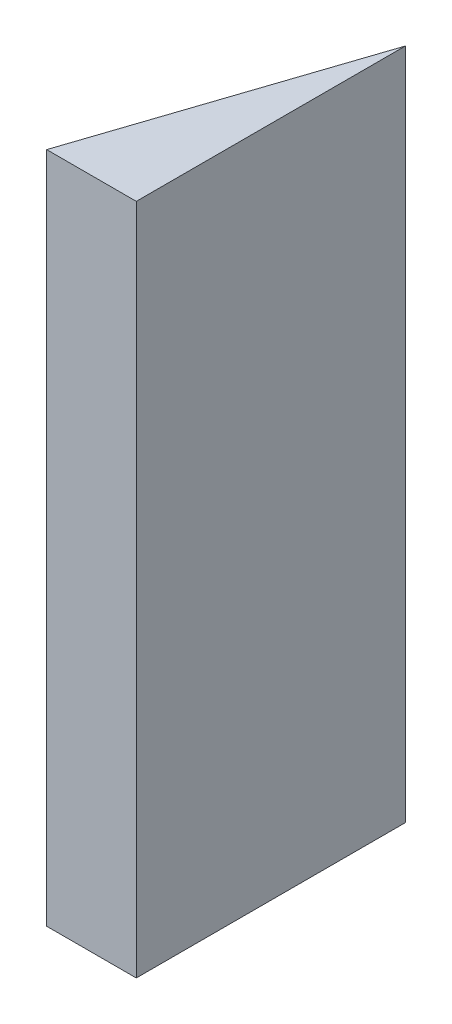
ISO-10303-21;
HEADER;
FILE_DESCRIPTION(('STEP AP214'),'2;1');
FILE_NAME('part.step','',(''),(''),'','','');
FILE_SCHEMA(('AUTOMOTIVE_DESIGN { 1 0 10303 214 1 1 1 1 }'));
ENDSEC;
DATA;
#1=APPLICATION_CONTEXT('core data for automotive mechanical design processes');
#2=APPLICATION_PROTOCOL_DEFINITION('international standard','automotive_design',2000,#1);
#3=PRODUCT_CONTEXT('',#1,'mechanical');
#4=PRODUCT('Part','Part','',(#3));
#5=PRODUCT_RELATED_PRODUCT_CATEGORY('part','',(#4));
#6=PRODUCT_DEFINITION_FORMATION('','',#4);
#7=PRODUCT_DEFINITION_CONTEXT('part definition',#1,'design');
#8=PRODUCT_DEFINITION('design','',#6,#7);
#9=PRODUCT_DEFINITION_SHAPE('','',#8);
#10=(LENGTH_UNIT() NAMED_UNIT(*) SI_UNIT(.MILLI.,.METRE.));
#11=(NAMED_UNIT(*) PLANE_ANGLE_UNIT() SI_UNIT($,.RADIAN.));
#12=(NAMED_UNIT(*) SI_UNIT($,.STERADIAN.) SOLID_ANGLE_UNIT());
#13=UNCERTAINTY_MEASURE_WITH_UNIT(LENGTH_MEASURE(1.E-05),#10,'distance_accuracy_value','');
#14=(GEOMETRIC_REPRESENTATION_CONTEXT(3) GLOBAL_UNCERTAINTY_ASSIGNED_CONTEXT((#13)) GLOBAL_UNIT_ASSIGNED_CONTEXT((#10,
#11,#12)) REPRESENTATION_CONTEXT('',''));
#15=CARTESIAN_POINT('',(0.,0.,0.));
#16=DIRECTION('',(0.,0.,1.));
#17=DIRECTION('',(1.,0.,0.));
#18=AXIS2_PLACEMENT_3D('',#15,#16,#17);
#19=CARTESIAN_POINT('',(3.92000030597973,1.74999949644381,-3.67112167398592));
#20=DIRECTION('',(1.74845553146952E-07,1.,-8.74227765734759E-08));
#21=DIRECTION('',(-1.,1.74845553146952E-07,0.));
#22=AXIS2_PLACEMENT_3D('',#19,#20,#21);
#23=PLANE('',#22);
#24=DIRECTION('',(-0.315990463967198,1.38192967524257E-07,0.948762365759612));
#25=VECTOR('',#24,1.);
#26=CARTESIAN_POINT('',(3.90000030597973,1.74999950168917,-3.65112167398592));
#27=LINE('',#26,#25);
#28=CARTESIAN_POINT('',(3.90000030597973,1.74999950168817,-3.65112167398592));
#29=VERTEX_POINT('',#28);
#30=CARTESIAN_POINT('',(3.76677813133574,1.74999955995059,-3.25112167398592));
#31=VERTEX_POINT('',#30);
#32=EDGE_CURVE('E11',#29,#31,#27,.T.);
#33=ORIENTED_EDGE('',*,*,#32,.T.);
#34=DIRECTION('',(0.999999999999985,-1.74845553322982E-07,0.));
#35=VECTOR('',#34,1.);
#36=CARTESIAN_POINT('',(3.76677813133574,1.74999955995159,-3.25112167398592));
#37=LINE('',#36,#35);
#38=CARTESIAN_POINT('',(3.90000030597974,1.74999953665728,-3.25112167398592));
#39=VERTEX_POINT('',#38);
#40=EDGE_CURVE('E49',#31,#39,#37,.T.);
#41=ORIENTED_EDGE('',*,*,#40,.T.);
#42=DIRECTION('',(0.,-8.74227762404086E-08,-0.999999999999996));
#43=VECTOR('',#42,1.);
#44=CARTESIAN_POINT('',(3.90000030597974,1.74999953665828,-3.25112167398592));
#45=LINE('',#44,#43);
#46=EDGE_CURVE('E47',#39,#29,#45,.T.);
#47=ORIENTED_EDGE('',*,*,#46,.T.);
#48=EDGE_LOOP('',(#33,#41,#47));
#49=FACE_BOUND('',#48,.T.);
#50=ADVANCED_FACE('F17',(#49),#23,.T.);
#51=CARTESIAN_POINT('',(3.92000013113418,0.749999496443807,-3.67112158656315));
#52=DIRECTION('',(1.74845553146952E-07,1.,-8.74227765734759E-08));
#53=DIRECTION('',(-1.,1.74845553146952E-07,0.));
#54=AXIS2_PLACEMENT_3D('',#51,#52,#53);
#55=PLANE('',#54);
#56=DIRECTION('',(0.,-8.74227767955203E-08,-0.999999999999996));
#57=VECTOR('',#56,1.);
#58=CARTESIAN_POINT('',(3.90000013113418,0.749999536658284,-3.25112158656315));
#59=LINE('',#58,#57);
#60=CARTESIAN_POINT('',(3.90000013113418,0.749999536659284,-3.25112158656315));
#61=VERTEX_POINT('',#60);
#62=CARTESIAN_POINT('',(3.90000013113418,0.749999501690174,-3.65112158656315));
#63=VERTEX_POINT('',#62);
#64=EDGE_CURVE('E24',#61,#63,#59,.T.);
#65=ORIENTED_EDGE('',*,*,#64,.F.);
#66=DIRECTION('',(0.999999999999985,-1.74845553322983E-07,0.));
#67=VECTOR('',#66,1.);
#68=CARTESIAN_POINT('',(3.76677795649018,0.749999559951589,-3.25112158656315));
#69=LINE('',#68,#67);
#70=CARTESIAN_POINT('',(3.76677795649018,0.749999559952589,-3.25112158656315));
#71=VERTEX_POINT('',#70);
#72=EDGE_CURVE('E53',#71,#61,#69,.T.);
#73=ORIENTED_EDGE('',*,*,#72,.F.);
#74=DIRECTION('',(-0.315990463967198,1.38192967524256E-07,0.948762365759612));
#75=VECTOR('',#74,1.);
#76=CARTESIAN_POINT('',(3.90000013113418,0.749999501689173,-3.65112158656315));
#77=LINE('',#76,#75);
#78=EDGE_CURVE('E68',#63,#71,#77,.T.);
#79=ORIENTED_EDGE('',*,*,#78,.F.);
#80=EDGE_LOOP('',(#65,#73,#79));
#81=FACE_BOUND('',#80,.T.);
#82=ADVANCED_FACE('F73',(#81),#55,.F.);
#83=CARTESIAN_POINT('',(3.90000030597973,1.74999950168917,-3.65112167398592));
#84=DIRECTION('',(0.948762365759622,-1.3826211694183E-07,0.315990463967214));
#85=DIRECTION('',(-0.315990463967199,1.38192967784634E-07,0.948762365759617));
#86=AXIS2_PLACEMENT_3D('',#83,#84,#85);
#87=PLANE('',#86);
#88=DIRECTION('',(-1.74845553146948E-07,-0.999999999999981,8.74227765734742E-08));
#89=VECTOR('',#88,1.);
#90=CARTESIAN_POINT('',(3.90000030597973,1.74999950168917,-3.65112167398592));
#91=LINE('',#90,#89);
#92=EDGE_CURVE('E59',#29,#63,#91,.T.);
#93=ORIENTED_EDGE('',*,*,#92,.T.);
#94=ORIENTED_EDGE('',*,*,#78,.T.);
#95=DIRECTION('',(-1.74845553146948E-07,-0.999999999999981,8.74227765734742E-08));
#96=VECTOR('',#95,1.);
#97=CARTESIAN_POINT('',(3.76677813133574,1.74999955995159,-3.25112167398592));
#98=LINE('',#97,#96);
#99=EDGE_CURVE('E54',#31,#71,#98,.T.);
#100=ORIENTED_EDGE('',*,*,#99,.F.);
#101=ORIENTED_EDGE('',*,*,#32,.F.);
#102=EDGE_LOOP('',(#93,#94,#100,#101));
#103=FACE_BOUND('',#102,.T.);
#104=ADVANCED_FACE('F57',(#103),#87,.F.);
#105=CARTESIAN_POINT('',(3.76677813133574,1.74999955995159,-3.25112167398592));
#106=DIRECTION('',(0.,-8.74227765734759E-08,-1.));
#107=DIRECTION('',(1.,-1.74845553146952E-07,0.));
#108=AXIS2_PLACEMENT_3D('',#105,#106,#107);
#109=PLANE('',#108);
#110=ORIENTED_EDGE('',*,*,#99,.T.);
#111=ORIENTED_EDGE('',*,*,#72,.T.);
#112=DIRECTION('',(-1.74845553146948E-07,-0.999999999999981,8.74227765734742E-08));
#113=VECTOR('',#112,1.);
#114=CARTESIAN_POINT('',(3.90000030597974,1.74999953665828,-3.25112167398592));
#115=LINE('',#114,#113);
#116=EDGE_CURVE('E70',#39,#61,#115,.T.);
#117=ORIENTED_EDGE('',*,*,#116,.F.);
#118=ORIENTED_EDGE('',*,*,#40,.F.);
#119=EDGE_LOOP('',(#110,#111,#117,#118));
#120=FACE_BOUND('',#119,.T.);
#121=ADVANCED_FACE('F72',(#120),#109,.F.);
#122=CARTESIAN_POINT('',(3.90000030597974,1.74999953665828,-3.25112167398592));
#123=DIRECTION('',(-1.,1.74845553146952E-07,0.));
#124=DIRECTION('',(0.,-8.74227765734759E-08,-1.));
#125=AXIS2_PLACEMENT_3D('',#122,#123,#124);
#126=PLANE('',#125);
#127=ORIENTED_EDGE('',*,*,#116,.T.);
#128=ORIENTED_EDGE('',*,*,#64,.T.);
#129=ORIENTED_EDGE('',*,*,#92,.F.);
#130=ORIENTED_EDGE('',*,*,#46,.F.);
#131=EDGE_LOOP('',(#127,#128,#129,#130));
#132=FACE_BOUND('',#131,.T.);
#133=ADVANCED_FACE('F61',(#132),#126,.F.);
#134=CLOSED_SHELL('',(#50,#82,#104,#121,#133));
#135=MANIFOLD_SOLID_BREP('B1',#134);
#136=ADVANCED_BREP_SHAPE_REPRESENTATION('',(#18,#135),#14);
#137=SHAPE_DEFINITION_REPRESENTATION(#9,#136);
ENDSEC;
END-ISO-10303-21;
